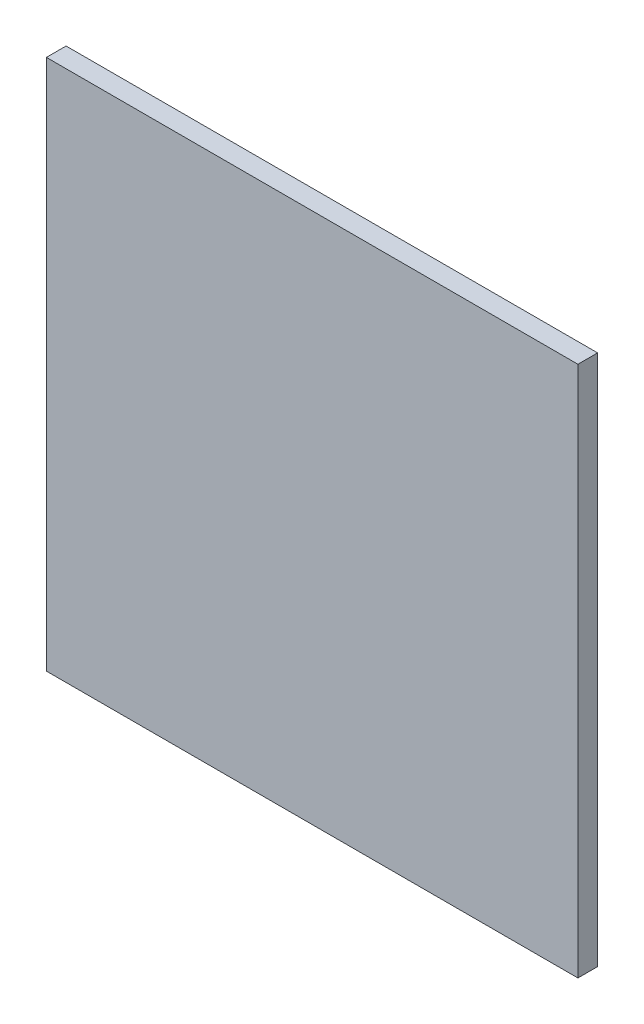
ISO-10303-21;
HEADER;
FILE_DESCRIPTION(('STEP AP214'),'2;1');
FILE_NAME('part.step','',(''),(''),'','','');
FILE_SCHEMA(('AUTOMOTIVE_DESIGN { 1 0 10303 214 1 1 1 1 }'));
ENDSEC;
DATA;
#1=APPLICATION_CONTEXT('core data for automotive mechanical design processes');
#2=APPLICATION_PROTOCOL_DEFINITION('international standard','automotive_design',2000,#1);
#3=PRODUCT_CONTEXT('',#1,'mechanical');
#4=PRODUCT('Part','Part','',(#3));
#5=PRODUCT_RELATED_PRODUCT_CATEGORY('part','',(#4));
#6=PRODUCT_DEFINITION_FORMATION('','',#4);
#7=PRODUCT_DEFINITION_CONTEXT('part definition',#1,'design');
#8=PRODUCT_DEFINITION('design','',#6,#7);
#9=PRODUCT_DEFINITION_SHAPE('','',#8);
#10=(LENGTH_UNIT() NAMED_UNIT(*) SI_UNIT(.MILLI.,.METRE.));
#11=(NAMED_UNIT(*) PLANE_ANGLE_UNIT() SI_UNIT($,.RADIAN.));
#12=(NAMED_UNIT(*) SI_UNIT($,.STERADIAN.) SOLID_ANGLE_UNIT());
#13=UNCERTAINTY_MEASURE_WITH_UNIT(LENGTH_MEASURE(1.E-05),#10,'distance_accuracy_value','');
#14=(GEOMETRIC_REPRESENTATION_CONTEXT(3) GLOBAL_UNCERTAINTY_ASSIGNED_CONTEXT((#13)) GLOBAL_UNIT_ASSIGNED_CONTEXT((#10,
#11,#12)) REPRESENTATION_CONTEXT('',''));
#15=CARTESIAN_POINT('',(0.,0.,0.));
#16=DIRECTION('',(0.,0.,1.));
#17=DIRECTION('',(1.,0.,0.));
#18=AXIS2_PLACEMENT_3D('',#15,#16,#17);
#19=CARTESIAN_POINT('',(0.,0.,0.));
#20=DIRECTION('',(1.,0.,0.));
#21=DIRECTION('',(0.,0.,1.));
#22=AXIS2_PLACEMENT_3D('',#19,#20,#21);
#23=PLANE('',#22);
#24=DIRECTION('',(0.,1.,0.));
#25=VECTOR('',#24,1.);
#26=CARTESIAN_POINT('',(0.,0.,0.1));
#27=LINE('',#26,#25);
#28=CARTESIAN_POINT('',(0.,0.,0.1));
#29=VERTEX_POINT('',#28);
#30=CARTESIAN_POINT('',(0.,2.7,0.1));
#31=VERTEX_POINT('',#30);
#32=EDGE_CURVE('E11',#29,#31,#27,.T.);
#33=ORIENTED_EDGE('',*,*,#32,.T.);
#34=DIRECTION('',(0.,0.,1.));
#35=VECTOR('',#34,1.);
#36=CARTESIAN_POINT('',(0.,2.7,0.));
#37=LINE('',#36,#35);
#38=CARTESIAN_POINT('',(0.,2.7,0.));
#39=VERTEX_POINT('',#38);
#40=EDGE_CURVE('E24',#39,#31,#37,.T.);
#41=ORIENTED_EDGE('',*,*,#40,.F.);
#42=DIRECTION('',(0.,1.,0.));
#43=VECTOR('',#42,1.);
#44=CARTESIAN_POINT('',(0.,0.,0.));
#45=LINE('',#44,#43);
#46=CARTESIAN_POINT('',(0.,0.,0.));
#47=VERTEX_POINT('',#46);
#48=EDGE_CURVE('E86',#47,#39,#45,.T.);
#49=ORIENTED_EDGE('',*,*,#48,.F.);
#50=DIRECTION('',(0.,0.,1.));
#51=VECTOR('',#50,1.);
#52=CARTESIAN_POINT('',(0.,0.,0.));
#53=LINE('',#52,#51);
#54=EDGE_CURVE('E36',#47,#29,#53,.T.);
#55=ORIENTED_EDGE('',*,*,#54,.T.);
#56=EDGE_LOOP('',(#33,#41,#49,#55));
#57=FACE_BOUND('',#56,.T.);
#58=ADVANCED_FACE('F17',(#57),#23,.F.);
#59=CARTESIAN_POINT('',(2.7,0.,0.));
#60=DIRECTION('',(1.,0.,0.));
#61=DIRECTION('',(0.,0.,1.));
#62=AXIS2_PLACEMENT_3D('',#59,#60,#61);
#63=PLANE('',#62);
#64=DIRECTION('',(0.,0.,1.));
#65=VECTOR('',#64,1.);
#66=CARTESIAN_POINT('',(2.7,0.,0.));
#67=LINE('',#66,#65);
#68=CARTESIAN_POINT('',(2.7,0.,0.));
#69=VERTEX_POINT('',#68);
#70=CARTESIAN_POINT('',(2.7,0.,0.1));
#71=VERTEX_POINT('',#70);
#72=EDGE_CURVE('E83',#69,#71,#67,.T.);
#73=ORIENTED_EDGE('',*,*,#72,.F.);
#74=DIRECTION('',(0.,1.,0.));
#75=VECTOR('',#74,1.);
#76=CARTESIAN_POINT('',(2.7,0.,0.));
#77=LINE('',#76,#75);
#78=CARTESIAN_POINT('',(2.7,2.7,0.));
#79=VERTEX_POINT('',#78);
#80=EDGE_CURVE('E63',#69,#79,#77,.T.);
#81=ORIENTED_EDGE('',*,*,#80,.T.);
#82=DIRECTION('',(0.,0.,1.));
#83=VECTOR('',#82,1.);
#84=CARTESIAN_POINT('',(2.7,2.7,0.));
#85=LINE('',#84,#83);
#86=CARTESIAN_POINT('',(2.7,2.7,0.1));
#87=VERTEX_POINT('',#86);
#88=EDGE_CURVE('E57',#79,#87,#85,.T.);
#89=ORIENTED_EDGE('',*,*,#88,.T.);
#90=DIRECTION('',(0.,1.,0.));
#91=VECTOR('',#90,1.);
#92=CARTESIAN_POINT('',(2.7,0.,0.1));
#93=LINE('',#92,#91);
#94=EDGE_CURVE('E60',#71,#87,#93,.T.);
#95=ORIENTED_EDGE('',*,*,#94,.F.);
#96=EDGE_LOOP('',(#73,#81,#89,#95));
#97=FACE_BOUND('',#96,.T.);
#98=ADVANCED_FACE('F59',(#97),#63,.T.);
#99=CARTESIAN_POINT('',(0.,0.,0.));
#100=DIRECTION('',(0.,1.,0.));
#101=DIRECTION('',(0.,0.,1.));
#102=AXIS2_PLACEMENT_3D('',#99,#100,#101);
#103=PLANE('',#102);
#104=ORIENTED_EDGE('',*,*,#72,.T.);
#105=DIRECTION('',(1.,0.,0.));
#106=VECTOR('',#105,1.);
#107=CARTESIAN_POINT('',(0.,0.,0.1));
#108=LINE('',#107,#106);
#109=EDGE_CURVE('E71',#29,#71,#108,.T.);
#110=ORIENTED_EDGE('',*,*,#109,.F.);
#111=ORIENTED_EDGE('',*,*,#54,.F.);
#112=DIRECTION('',(1.,0.,0.));
#113=VECTOR('',#112,1.);
#114=CARTESIAN_POINT('',(0.,0.,0.));
#115=LINE('',#114,#113);
#116=EDGE_CURVE('E76',#47,#69,#115,.T.);
#117=ORIENTED_EDGE('',*,*,#116,.T.);
#118=EDGE_LOOP('',(#104,#110,#111,#117));
#119=FACE_BOUND('',#118,.T.);
#120=ADVANCED_FACE('F91',(#119),#103,.F.);
#121=CARTESIAN_POINT('',(0.,2.7,0.));
#122=DIRECTION('',(0.,1.,0.));
#123=DIRECTION('',(0.,0.,1.));
#124=AXIS2_PLACEMENT_3D('',#121,#122,#123);
#125=PLANE('',#124);
#126=DIRECTION('',(1.,0.,0.));
#127=VECTOR('',#126,1.);
#128=CARTESIAN_POINT('',(0.,2.7,0.));
#129=LINE('',#128,#127);
#130=EDGE_CURVE('E74',#39,#79,#129,.T.);
#131=ORIENTED_EDGE('',*,*,#130,.F.);
#132=ORIENTED_EDGE('',*,*,#40,.T.);
#133=DIRECTION('',(1.,0.,0.));
#134=VECTOR('',#133,1.);
#135=CARTESIAN_POINT('',(0.,2.7,0.1));
#136=LINE('',#135,#134);
#137=EDGE_CURVE('E69',#31,#87,#136,.T.);
#138=ORIENTED_EDGE('',*,*,#137,.T.);
#139=ORIENTED_EDGE('',*,*,#88,.F.);
#140=EDGE_LOOP('',(#131,#132,#138,#139));
#141=FACE_BOUND('',#140,.T.);
#142=ADVANCED_FACE('F73',(#141),#125,.T.);
#143=CARTESIAN_POINT('',(0.,0.,0.));
#144=DIRECTION('',(0.,0.,1.));
#145=DIRECTION('',(1.,0.,0.));
#146=AXIS2_PLACEMENT_3D('',#143,#144,#145);
#147=PLANE('',#146);
#148=ORIENTED_EDGE('',*,*,#130,.T.);
#149=ORIENTED_EDGE('',*,*,#80,.F.);
#150=ORIENTED_EDGE('',*,*,#116,.F.);
#151=ORIENTED_EDGE('',*,*,#48,.T.);
#152=EDGE_LOOP('',(#148,#149,#150,#151));
#153=FACE_BOUND('',#152,.T.);
#154=ADVANCED_FACE('F89',(#153),#147,.F.);
#155=CARTESIAN_POINT('',(0.,0.,0.1));
#156=DIRECTION('',(0.,0.,1.));
#157=DIRECTION('',(1.,0.,0.));
#158=AXIS2_PLACEMENT_3D('',#155,#156,#157);
#159=PLANE('',#158);
#160=ORIENTED_EDGE('',*,*,#32,.F.);
#161=ORIENTED_EDGE('',*,*,#109,.T.);
#162=ORIENTED_EDGE('',*,*,#94,.T.);
#163=ORIENTED_EDGE('',*,*,#137,.F.);
#164=EDGE_LOOP('',(#160,#161,#162,#163));
#165=FACE_BOUND('',#164,.T.);
#166=ADVANCED_FACE('F68',(#165),#159,.T.);
#167=CLOSED_SHELL('',(#58,#98,#120,#142,#154,#166));
#168=MANIFOLD_SOLID_BREP('B1',#167);
#169=ADVANCED_BREP_SHAPE_REPRESENTATION('',(#18,#168),#14);
#170=SHAPE_DEFINITION_REPRESENTATION(#9,#169);
ENDSEC;
END-ISO-10303-21;
